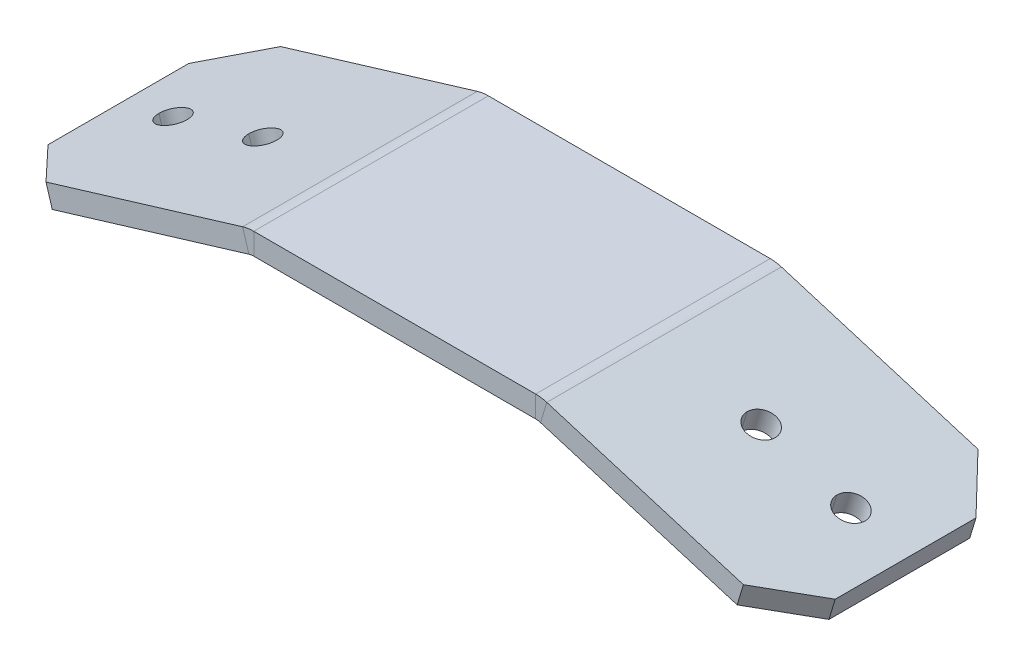
ISO-10303-21;
HEADER;
FILE_DESCRIPTION(('STEP AP214'),'2;1');
FILE_NAME('part.step','',(''),(''),'','','');
FILE_SCHEMA(('AUTOMOTIVE_DESIGN { 1 0 10303 214 1 1 1 1 }'));
ENDSEC;
DATA;
#1=APPLICATION_CONTEXT('core data for automotive mechanical design processes');
#2=APPLICATION_PROTOCOL_DEFINITION('international standard','automotive_design',2000,#1);
#3=PRODUCT_CONTEXT('',#1,'mechanical');
#4=PRODUCT('Part','Part','',(#3));
#5=PRODUCT_RELATED_PRODUCT_CATEGORY('part','',(#4));
#6=PRODUCT_DEFINITION_FORMATION('','',#4);
#7=PRODUCT_DEFINITION_CONTEXT('part definition',#1,'design');
#8=PRODUCT_DEFINITION('design','',#6,#7);
#9=PRODUCT_DEFINITION_SHAPE('','',#8);
#10=(LENGTH_UNIT() NAMED_UNIT(*) SI_UNIT(.MILLI.,.METRE.));
#11=(NAMED_UNIT(*) PLANE_ANGLE_UNIT() SI_UNIT($,.RADIAN.));
#12=(NAMED_UNIT(*) SI_UNIT($,.STERADIAN.) SOLID_ANGLE_UNIT());
#13=UNCERTAINTY_MEASURE_WITH_UNIT(LENGTH_MEASURE(1.E-05),#10,'distance_accuracy_value','');
#14=(GEOMETRIC_REPRESENTATION_CONTEXT(3) GLOBAL_UNCERTAINTY_ASSIGNED_CONTEXT((#13)) GLOBAL_UNIT_ASSIGNED_CONTEXT((#10,
#11,#12)) REPRESENTATION_CONTEXT('',''));
#15=CARTESIAN_POINT('',(0.,0.,0.));
#16=DIRECTION('',(0.,0.,1.));
#17=DIRECTION('',(1.,0.,0.));
#18=AXIS2_PLACEMENT_3D('',#15,#16,#17);
#19=CARTESIAN_POINT('',(33.7222877567762,5.92021227907714,0.));
#20=DIRECTION('',(0.289867105644568,0.957066905218878,0.));
#21=DIRECTION('',(-0.957066905218878,0.289867105644568,0.));
#22=AXIS2_PLACEMENT_3D('',#19,#20,#21);
#23=CYLINDRICAL_SURFACE('',#22,1.984375);
#24=CARTESIAN_POINT('',(32.8755859411883,3.1246198489328,0.));
#25=DIRECTION('',(-0.289867105644568,-0.957066905218878,0.));
#26=DIRECTION('',(0.957066905218878,-0.289867105644568,0.));
#27=AXIS2_PLACEMENT_3D('',#24,#25,#26);
#28=CIRCLE('',#27,1.984375);
#29=CARTESIAN_POINT('',(30.9764063011446,3.69982488669623,0.));
#30=VERTEX_POINT('',#29);
#31=CARTESIAN_POINT('',(34.774765581232,2.54941481116936,0.));
#32=VERTEX_POINT('',#31);
#33=EDGE_CURVE('E11',#30,#32,#28,.T.);
#34=ORIENTED_EDGE('',*,*,#33,.T.);
#35=DIRECTION('',(0.289867105644568,0.957066905218878,0.));
#36=VECTOR('',#35,1.);
#37=CARTESIAN_POINT('',(35.6214673968199,5.3450072413137,0.));
#38=LINE('',#37,#36);
#39=CARTESIAN_POINT('',(35.6214673968199,5.3450072413137,0.));
#40=VERTEX_POINT('',#39);
#41=EDGE_CURVE('E28',#32,#40,#38,.T.);
#42=ORIENTED_EDGE('',*,*,#41,.T.);
#43=CARTESIAN_POINT('',(33.7222877567762,5.92021227907714,0.));
#44=DIRECTION('',(0.289867105644568,0.957066905218878,0.));
#45=DIRECTION('',(-0.957066905218878,0.289867105644568,0.));
#46=AXIS2_PLACEMENT_3D('',#43,#44,#45);
#47=CIRCLE('',#46,1.984375);
#48=CARTESIAN_POINT('',(31.8231081167324,6.49541731684057,0.));
#49=VERTEX_POINT('',#48);
#50=EDGE_CURVE('E309',#40,#49,#47,.T.);
#51=ORIENTED_EDGE('',*,*,#50,.T.);
#52=DIRECTION('',(0.289867105644568,0.957066905218878,0.));
#53=VECTOR('',#52,1.);
#54=CARTESIAN_POINT('',(31.8231081167324,6.49541731684057,0.));
#55=LINE('',#54,#53);
#56=EDGE_CURVE('E263',#30,#49,#55,.T.);
#57=ORIENTED_EDGE('',*,*,#56,.F.);
#58=EDGE_LOOP('',(#34,#42,#51,#57));
#59=FACE_BOUND('',#58,.T.);
#60=ADVANCED_FACE('F17',(#59),#23,.F.);
#61=CARTESIAN_POINT('',(45.8770374530559,2.23890003739113,0.));
#62=DIRECTION('',(0.289867105644568,0.957066905218878,0.));
#63=DIRECTION('',(-0.957066905218878,0.289867105644568,0.));
#64=AXIS2_PLACEMENT_3D('',#61,#62,#63);
#65=CYLINDRICAL_SURFACE('',#64,1.984375);
#66=CARTESIAN_POINT('',(45.0303356374681,-0.556692392753209,0.));
#67=DIRECTION('',(-0.289867105644568,-0.957066905218878,0.));
#68=DIRECTION('',(0.957066905218878,-0.289867105644568,0.));
#69=AXIS2_PLACEMENT_3D('',#66,#67,#68);
#70=CIRCLE('',#69,1.984375);
#71=CARTESIAN_POINT('',(43.1311559974244,0.018512645010225,0.));
#72=VERTEX_POINT('',#71);
#73=CARTESIAN_POINT('',(46.9295152775118,-1.13189743051664,0.));
#74=VERTEX_POINT('',#73);
#75=EDGE_CURVE('E305',#72,#74,#70,.T.);
#76=ORIENTED_EDGE('',*,*,#75,.T.);
#77=DIRECTION('',(0.289867105644568,0.957066905218878,0.));
#78=VECTOR('',#77,1.);
#79=CARTESIAN_POINT('',(47.7762170930996,1.66369499962769,0.));
#80=LINE('',#79,#78);
#81=CARTESIAN_POINT('',(47.7762170930996,1.6636949996277,0.));
#82=VERTEX_POINT('',#81);
#83=EDGE_CURVE('E310',#74,#82,#80,.T.);
#84=ORIENTED_EDGE('',*,*,#83,.T.);
#85=CARTESIAN_POINT('',(45.8770374530559,2.23890003739114,0.));
#86=DIRECTION('',(0.289867105644568,0.957066905218878,0.));
#87=DIRECTION('',(-0.957066905218878,0.289867105644568,0.));
#88=AXIS2_PLACEMENT_3D('',#85,#86,#87);
#89=CIRCLE('',#88,1.984375);
#90=CARTESIAN_POINT('',(43.9778578130121,2.81410507515457,0.));
#91=VERTEX_POINT('',#90);
#92=EDGE_CURVE('E417',#82,#91,#89,.T.);
#93=ORIENTED_EDGE('',*,*,#92,.T.);
#94=DIRECTION('',(0.289867105644568,0.957066905218878,0.));
#95=VECTOR('',#94,1.);
#96=CARTESIAN_POINT('',(43.9778578130121,2.81410507515457,0.));
#97=LINE('',#96,#95);
#98=EDGE_CURVE('E300',#72,#91,#97,.T.);
#99=ORIENTED_EDGE('',*,*,#98,.F.);
#100=EDGE_LOOP('',(#76,#84,#93,#99));
#101=FACE_BOUND('',#100,.T.);
#102=ADVANCED_FACE('F630',(#101),#65,.F.);
#103=CARTESIAN_POINT('',(-33.7222877567762,5.92021227907714,0.));
#104=DIRECTION('',(-0.289867105644568,0.957066905218878,0.));
#105=DIRECTION('',(-0.957066905218878,-0.289867105644568,0.));
#106=AXIS2_PLACEMENT_3D('',#103,#104,#105);
#107=CYLINDRICAL_SURFACE('',#106,1.984375);
#108=CARTESIAN_POINT('',(-32.8755859411883,3.12461984893278,0.));
#109=DIRECTION('',(0.289867105644568,-0.957066905218878,0.));
#110=DIRECTION('',(0.957066905218878,0.289867105644568,0.));
#111=AXIS2_PLACEMENT_3D('',#108,#109,#110);
#112=CIRCLE('',#111,1.984375);
#113=CARTESIAN_POINT('',(-34.774765581232,2.54941481116935,0.));
#114=VERTEX_POINT('',#113);
#115=CARTESIAN_POINT('',(-30.9764063011446,3.69982488669622,0.));
#116=VERTEX_POINT('',#115);
#117=EDGE_CURVE('E353',#114,#116,#112,.T.);
#118=ORIENTED_EDGE('',*,*,#117,.T.);
#119=DIRECTION('',(-0.289867105644568,0.957066905218878,0.));
#120=VECTOR('',#119,1.);
#121=CARTESIAN_POINT('',(-31.8231081167324,6.49541731684057,0.));
#122=LINE('',#121,#120);
#123=CARTESIAN_POINT('',(-31.8231081167324,6.49541731684057,0.));
#124=VERTEX_POINT('',#123);
#125=EDGE_CURVE('E293',#116,#124,#122,.T.);
#126=ORIENTED_EDGE('',*,*,#125,.T.);
#127=CARTESIAN_POINT('',(-33.7222877567762,5.92021227907714,0.));
#128=DIRECTION('',(-0.289867105644568,0.957066905218878,0.));
#129=DIRECTION('',(-0.957066905218878,-0.289867105644568,0.));
#130=AXIS2_PLACEMENT_3D('',#127,#128,#129);
#131=CIRCLE('',#130,1.984375);
#132=CARTESIAN_POINT('',(-35.6214673968199,5.3450072413137,0.));
#133=VERTEX_POINT('',#132);
#134=EDGE_CURVE('E289',#124,#133,#131,.T.);
#135=ORIENTED_EDGE('',*,*,#134,.T.);
#136=DIRECTION('',(-0.289867105644568,0.957066905218878,0.));
#137=VECTOR('',#136,1.);
#138=CARTESIAN_POINT('',(-35.6214673968199,5.3450072413137,0.));
#139=LINE('',#138,#137);
#140=EDGE_CURVE('E475',#114,#133,#139,.T.);
#141=ORIENTED_EDGE('',*,*,#140,.F.);
#142=EDGE_LOOP('',(#118,#126,#135,#141));
#143=FACE_BOUND('',#142,.T.);
#144=ADVANCED_FACE('F637',(#143),#107,.F.);
#145=CARTESIAN_POINT('',(-45.8770374530559,2.23890003739113,0.));
#146=DIRECTION('',(-0.289867105644568,0.957066905218878,0.));
#147=DIRECTION('',(-0.957066905218878,-0.289867105644568,0.));
#148=AXIS2_PLACEMENT_3D('',#145,#146,#147);
#149=CYLINDRICAL_SURFACE('',#148,1.984375);
#150=CARTESIAN_POINT('',(-45.0303356374681,-0.556692392753219,0.));
#151=DIRECTION('',(0.289867105644568,-0.957066905218878,0.));
#152=DIRECTION('',(0.957066905218878,0.289867105644568,0.));
#153=AXIS2_PLACEMENT_3D('',#150,#151,#152);
#154=CIRCLE('',#153,1.984375);
#155=CARTESIAN_POINT('',(-46.9295152775118,-1.13189743051665,0.));
#156=VERTEX_POINT('',#155);
#157=CARTESIAN_POINT('',(-43.1311559974244,0.0185126450102154,0.));
#158=VERTEX_POINT('',#157);
#159=EDGE_CURVE('E294',#156,#158,#154,.T.);
#160=ORIENTED_EDGE('',*,*,#159,.T.);
#161=DIRECTION('',(-0.289867105644568,0.957066905218878,0.));
#162=VECTOR('',#161,1.);
#163=CARTESIAN_POINT('',(-43.9778578130121,2.81410507515457,0.));
#164=LINE('',#163,#162);
#165=CARTESIAN_POINT('',(-43.9778578130121,2.81410507515457,0.));
#166=VERTEX_POINT('',#165);
#167=EDGE_CURVE('E162',#158,#166,#164,.T.);
#168=ORIENTED_EDGE('',*,*,#167,.T.);
#169=CARTESIAN_POINT('',(-45.8770374530559,2.23890003739114,0.));
#170=DIRECTION('',(-0.289867105644568,0.957066905218878,0.));
#171=DIRECTION('',(-0.957066905218878,-0.289867105644568,0.));
#172=AXIS2_PLACEMENT_3D('',#169,#170,#171);
#173=CIRCLE('',#172,1.984375);
#174=CARTESIAN_POINT('',(-47.7762170930996,1.6636949996277,0.));
#175=VERTEX_POINT('',#174);
#176=EDGE_CURVE('E174',#166,#175,#173,.T.);
#177=ORIENTED_EDGE('',*,*,#176,.T.);
#178=DIRECTION('',(-0.289867105644568,0.957066905218878,0.));
#179=VECTOR('',#178,1.);
#180=CARTESIAN_POINT('',(-47.7762170930996,1.66369499962769,0.));
#181=LINE('',#180,#179);
#182=EDGE_CURVE('E295',#156,#175,#181,.T.);
#183=ORIENTED_EDGE('',*,*,#182,.F.);
#184=EDGE_LOOP('',(#160,#168,#177,#183));
#185=FACE_BOUND('',#184,.T.);
#186=ADVANCED_FACE('F657',(#185),#149,.F.);
#187=CARTESIAN_POINT('',(-20.5818634814597,9.90005604011125,-15.875));
#188=DIRECTION('',(0.,0.,-1.));
#189=DIRECTION('',(0.,-1.,0.));
#190=AXIS2_PLACEMENT_3D('',#187,#188,#189);
#191=PLANE('',#190);
#192=DIRECTION('',(0.289867105644566,-0.957066905218879,0.));
#193=VECTOR('',#192,1.);
#194=CARTESIAN_POINT('',(-20.5818634814597,9.90005604011125,-15.875));
#195=LINE('',#194,#193);
#196=CARTESIAN_POINT('',(-20.5818634814597,9.90005604011125,-15.875));
#197=VERTEX_POINT('',#196);
#198=CARTESIAN_POINT('',(-19.7351616658719,7.10446360996689,-15.875));
#199=VERTEX_POINT('',#198);
#200=EDGE_CURVE('E259',#197,#199,#195,.T.);
#201=ORIENTED_EDGE('',*,*,#200,.F.);
#202=CARTESIAN_POINT('',(-19.0725254623684,4.91660866463653,-15.875));
#203=DIRECTION('',(0.,0.,-1.));
#204=DIRECTION('',(1.,0.,0.));
#205=AXIS2_PLACEMENT_3D('',#202,#203,#204);
#206=CIRCLE('',#205,5.207);
#207=CARTESIAN_POINT('',(-19.0725254623684,10.1236086646365,-15.875));
#208=VERTEX_POINT('',#207);
#209=EDGE_CURVE('E420',#197,#208,#206,.T.);
#210=ORIENTED_EDGE('',*,*,#209,.T.);
#211=DIRECTION('',(0.,1.,0.));
#212=VECTOR('',#211,1.);
#213=CARTESIAN_POINT('',(-19.0725254623684,7.20260866463652,-15.875));
#214=LINE('',#213,#212);
#215=CARTESIAN_POINT('',(-19.0725254623684,7.20260866463652,-15.875));
#216=VERTEX_POINT('',#215);
#217=EDGE_CURVE('E21',#216,#208,#214,.T.);
#218=ORIENTED_EDGE('',*,*,#217,.F.);
#219=CARTESIAN_POINT('',(-19.0725254623684,4.91660866463653,-15.875));
#220=DIRECTION('',(0.,0.,-1.));
#221=DIRECTION('',(1.,0.,0.));
#222=AXIS2_PLACEMENT_3D('',#219,#220,#221);
#223=CIRCLE('',#222,2.286);
#224=EDGE_CURVE('E311',#199,#216,#223,.T.);
#225=ORIENTED_EDGE('',*,*,#224,.F.);
#226=EDGE_LOOP('',(#201,#210,#218,#225));
#227=FACE_BOUND('',#226,.T.);
#228=ADVANCED_FACE('F531',(#227),#191,.T.);
#229=CARTESIAN_POINT('',(-19.0725254623684,7.20260866463652,-15.875));
#230=DIRECTION('',(0.,0.,-1.));
#231=DIRECTION('',(0.,-1.,0.));
#232=AXIS2_PLACEMENT_3D('',#229,#230,#231);
#233=PLANE('',#232);
#234=DIRECTION('',(0.957066905218878,0.289867105644568,0.));
#235=VECTOR('',#234,1.);
#236=CARTESIAN_POINT('',(-52.4226098491815,-2.79559243014434,-15.875));
#237=LINE('',#236,#235);
#238=CARTESIAN_POINT('',(-46.3452350010417,-0.954936309301339,-15.875));
#239=VERTEX_POINT('',#238);
#240=EDGE_CURVE('E242',#239,#199,#237,.T.);
#241=ORIENTED_EDGE('',*,*,#240,.F.);
#242=DIRECTION('',(-0.289867105644568,0.957066905218878,0.));
#243=VECTOR('',#242,1.);
#244=CARTESIAN_POINT('',(-47.1919368166294,1.840656120843,-15.875));
#245=LINE('',#244,#243);
#246=CARTESIAN_POINT('',(-47.1919368166294,1.840656120843,-15.875));
#247=VERTEX_POINT('',#246);
#248=EDGE_CURVE('E239',#239,#247,#245,.T.);
#249=ORIENTED_EDGE('',*,*,#248,.T.);
#250=DIRECTION('',(0.957066905218878,0.289867105644568,0.));
#251=VECTOR('',#250,1.);
#252=CARTESIAN_POINT('',(-53.2693116647693,0.,-15.875));
#253=LINE('',#252,#251);
#254=EDGE_CURVE('E255',#247,#197,#253,.T.);
#255=ORIENTED_EDGE('',*,*,#254,.T.);
#256=ORIENTED_EDGE('',*,*,#200,.T.);
#257=EDGE_LOOP('',(#241,#249,#255,#256));
#258=FACE_BOUND('',#257,.T.);
#259=ADVANCED_FACE('F646',(#258),#233,.T.);
#260=CARTESIAN_POINT('',(-19.0725254623684,10.1236086646365,15.875));
#261=DIRECTION('',(0.,0.,1.));
#262=DIRECTION('',(1.,0.,0.));
#263=AXIS2_PLACEMENT_3D('',#260,#261,#262);
#264=PLANE('',#263);
#265=DIRECTION('',(0.,-1.,0.));
#266=VECTOR('',#265,1.);
#267=CARTESIAN_POINT('',(-19.0725254623684,10.1236086646365,15.875));
#268=LINE('',#267,#266);
#269=CARTESIAN_POINT('',(-19.0725254623684,10.1236086646365,15.875));
#270=VERTEX_POINT('',#269);
#271=CARTESIAN_POINT('',(-19.0725254623684,7.20260866463652,15.875));
#272=VERTEX_POINT('',#271);
#273=EDGE_CURVE('E323',#270,#272,#268,.T.);
#274=ORIENTED_EDGE('',*,*,#273,.F.);
#275=CARTESIAN_POINT('',(-19.0725254623684,4.91660866463653,15.875));
#276=DIRECTION('',(0.,0.,-1.));
#277=DIRECTION('',(1.,0.,0.));
#278=AXIS2_PLACEMENT_3D('',#275,#276,#277);
#279=CIRCLE('',#278,5.207);
#280=CARTESIAN_POINT('',(-20.5818634814597,9.90005604011125,15.875));
#281=VERTEX_POINT('',#280);
#282=EDGE_CURVE('E343',#281,#270,#279,.T.);
#283=ORIENTED_EDGE('',*,*,#282,.F.);
#284=DIRECTION('',(-0.289867105644566,0.957066905218879,0.));
#285=VECTOR('',#284,1.);
#286=CARTESIAN_POINT('',(-19.7351616658719,7.10446360996689,15.875));
#287=LINE('',#286,#285);
#288=CARTESIAN_POINT('',(-19.7351616658719,7.10446360996689,15.875));
#289=VERTEX_POINT('',#288);
#290=EDGE_CURVE('E284',#289,#281,#287,.T.);
#291=ORIENTED_EDGE('',*,*,#290,.F.);
#292=CARTESIAN_POINT('',(-19.0725254623684,4.91660866463653,15.875));
#293=DIRECTION('',(0.,0.,-1.));
#294=DIRECTION('',(1.,0.,0.));
#295=AXIS2_PLACEMENT_3D('',#292,#293,#294);
#296=CIRCLE('',#295,2.286);
#297=EDGE_CURVE('E330',#289,#272,#296,.T.);
#298=ORIENTED_EDGE('',*,*,#297,.T.);
#299=EDGE_LOOP('',(#274,#283,#291,#298));
#300=FACE_BOUND('',#299,.T.);
#301=ADVANCED_FACE('F648',(#300),#264,.T.);
#302=CARTESIAN_POINT('',(-19.7351616658719,7.10446360996689,15.875));
#303=DIRECTION('',(0.,0.,1.));
#304=DIRECTION('',(1.,0.,0.));
#305=AXIS2_PLACEMENT_3D('',#302,#303,#304);
#306=PLANE('',#305);
#307=DIRECTION('',(1.,0.,0.));
#308=VECTOR('',#307,1.);
#309=CARTESIAN_POINT('',(-19.84375,10.1236086646365,15.875));
#310=LINE('',#309,#308);
#311=CARTESIAN_POINT('',(19.0725254623683,10.1236086646365,15.875));
#312=VERTEX_POINT('',#311);
#313=EDGE_CURVE('E388',#270,#312,#310,.T.);
#314=ORIENTED_EDGE('',*,*,#313,.F.);
#315=ORIENTED_EDGE('',*,*,#273,.T.);
#316=DIRECTION('',(1.,0.,0.));
#317=VECTOR('',#316,1.);
#318=CARTESIAN_POINT('',(-19.84375,7.20260866463652,15.875));
#319=LINE('',#318,#317);
#320=CARTESIAN_POINT('',(19.0725254623683,7.20260866463655,15.875));
#321=VERTEX_POINT('',#320);
#322=EDGE_CURVE('E318',#272,#321,#319,.T.);
#323=ORIENTED_EDGE('',*,*,#322,.T.);
#324=DIRECTION('',(0.,1.,0.));
#325=VECTOR('',#324,1.);
#326=CARTESIAN_POINT('',(19.0725254623683,7.20260866463655,15.875));
#327=LINE('',#326,#325);
#328=EDGE_CURVE('E314',#321,#312,#327,.T.);
#329=ORIENTED_EDGE('',*,*,#328,.T.);
#330=EDGE_LOOP('',(#314,#315,#323,#329));
#331=FACE_BOUND('',#330,.T.);
#332=ADVANCED_FACE('F615',(#331),#306,.T.);
#333=CARTESIAN_POINT('',(19.0725254623683,10.1236086646365,-15.875));
#334=DIRECTION('',(0.,0.,-1.));
#335=DIRECTION('',(0.,-1.,0.));
#336=AXIS2_PLACEMENT_3D('',#333,#334,#335);
#337=PLANE('',#336);
#338=DIRECTION('',(0.,-1.,0.));
#339=VECTOR('',#338,1.);
#340=CARTESIAN_POINT('',(19.0725254623683,10.1236086646365,-15.875));
#341=LINE('',#340,#339);
#342=CARTESIAN_POINT('',(19.0725254623683,10.1236086646365,-15.875));
#343=VERTEX_POINT('',#342);
#344=CARTESIAN_POINT('',(19.0725254623683,7.20260866463655,-15.875));
#345=VERTEX_POINT('',#344);
#346=EDGE_CURVE('E337',#343,#345,#341,.T.);
#347=ORIENTED_EDGE('',*,*,#346,.F.);
#348=CARTESIAN_POINT('',(19.0725254623684,4.91660866463655,-15.875));
#349=DIRECTION('',(0.,0.,-1.));
#350=DIRECTION('',(1.,0.,0.));
#351=AXIS2_PLACEMENT_3D('',#348,#349,#350);
#352=CIRCLE('',#351,5.207);
#353=CARTESIAN_POINT('',(20.5818634814596,9.90005604011127,-15.875));
#354=VERTEX_POINT('',#353);
#355=EDGE_CURVE('E319',#343,#354,#352,.T.);
#356=ORIENTED_EDGE('',*,*,#355,.T.);
#357=DIRECTION('',(0.289867105644567,0.957066905218878,0.));
#358=VECTOR('',#357,1.);
#359=CARTESIAN_POINT('',(19.7351616658719,7.10446360996693,-15.875));
#360=LINE('',#359,#358);
#361=CARTESIAN_POINT('',(19.7351616658719,7.10446360996693,-15.875));
#362=VERTEX_POINT('',#361);
#363=EDGE_CURVE('E435',#362,#354,#360,.T.);
#364=ORIENTED_EDGE('',*,*,#363,.F.);
#365=CARTESIAN_POINT('',(19.0725254623684,4.91660866463655,-15.875));
#366=DIRECTION('',(0.,0.,-1.));
#367=DIRECTION('',(1.,0.,0.));
#368=AXIS2_PLACEMENT_3D('',#365,#366,#367);
#369=CIRCLE('',#368,2.286);
#370=EDGE_CURVE('E288',#345,#362,#369,.T.);
#371=ORIENTED_EDGE('',*,*,#370,.F.);
#372=EDGE_LOOP('',(#347,#356,#364,#371));
#373=FACE_BOUND('',#372,.T.);
#374=ADVANCED_FACE('F606',(#373),#337,.T.);
#375=CARTESIAN_POINT('',(19.7351616658719,7.10446360996693,-15.875));
#376=DIRECTION('',(0.,0.,-1.));
#377=DIRECTION('',(0.,-1.,0.));
#378=AXIS2_PLACEMENT_3D('',#375,#376,#377);
#379=PLANE('',#378);
#380=DIRECTION('',(1.,0.,0.));
#381=VECTOR('',#380,1.);
#382=CARTESIAN_POINT('',(-19.84375,10.1236086646365,-15.875));
#383=LINE('',#382,#381);
#384=EDGE_CURVE('E333',#208,#343,#383,.T.);
#385=ORIENTED_EDGE('',*,*,#384,.T.);
#386=ORIENTED_EDGE('',*,*,#346,.T.);
#387=DIRECTION('',(1.,0.,0.));
#388=VECTOR('',#387,1.);
#389=CARTESIAN_POINT('',(-19.84375,7.20260866463652,-15.875));
#390=LINE('',#389,#388);
#391=EDGE_CURVE('E274',#216,#345,#390,.T.);
#392=ORIENTED_EDGE('',*,*,#391,.F.);
#393=ORIENTED_EDGE('',*,*,#217,.T.);
#394=EDGE_LOOP('',(#385,#386,#392,#393));
#395=FACE_BOUND('',#394,.T.);
#396=ADVANCED_FACE('F607',(#395),#379,.T.);
#397=CARTESIAN_POINT('',(20.5818634814596,9.90005604011127,15.875));
#398=DIRECTION('',(0.,0.,1.));
#399=DIRECTION('',(1.,0.,0.));
#400=AXIS2_PLACEMENT_3D('',#397,#398,#399);
#401=PLANE('',#400);
#402=DIRECTION('',(-0.289867105644567,-0.957066905218878,0.));
#403=VECTOR('',#402,1.);
#404=CARTESIAN_POINT('',(20.5818634814596,9.90005604011127,15.875));
#405=LINE('',#404,#403);
#406=CARTESIAN_POINT('',(20.5818634814596,9.90005604011127,15.875));
#407=VERTEX_POINT('',#406);
#408=CARTESIAN_POINT('',(19.7351616658719,7.10446360996693,15.875));
#409=VERTEX_POINT('',#408);
#410=EDGE_CURVE('E272',#407,#409,#405,.T.);
#411=ORIENTED_EDGE('',*,*,#410,.F.);
#412=CARTESIAN_POINT('',(19.0725254623684,4.91660866463655,15.875));
#413=DIRECTION('',(0.,0.,-1.));
#414=DIRECTION('',(1.,0.,0.));
#415=AXIS2_PLACEMENT_3D('',#412,#413,#414);
#416=CIRCLE('',#415,5.207);
#417=EDGE_CURVE('E379',#312,#407,#416,.T.);
#418=ORIENTED_EDGE('',*,*,#417,.F.);
#419=ORIENTED_EDGE('',*,*,#328,.F.);
#420=CARTESIAN_POINT('',(19.0725254623684,4.91660866463655,15.875));
#421=DIRECTION('',(0.,0.,-1.));
#422=DIRECTION('',(1.,0.,0.));
#423=AXIS2_PLACEMENT_3D('',#420,#421,#422);
#424=CIRCLE('',#423,2.286);
#425=EDGE_CURVE('E357',#321,#409,#424,.T.);
#426=ORIENTED_EDGE('',*,*,#425,.T.);
#427=EDGE_LOOP('',(#411,#418,#419,#426));
#428=FACE_BOUND('',#427,.T.);
#429=ADVANCED_FACE('F616',(#428),#401,.T.);
#430=CARTESIAN_POINT('',(19.0725254623683,7.20260866463655,15.875));
#431=DIRECTION('',(0.,0.,1.));
#432=DIRECTION('',(1.,0.,0.));
#433=AXIS2_PLACEMENT_3D('',#430,#431,#432);
#434=PLANE('',#433);
#435=DIRECTION('',(0.957066905218878,-0.289867105644568,0.));
#436=VECTOR('',#435,1.);
#437=CARTESIAN_POINT('',(18.9970481844122,7.32801623449218,15.875));
#438=LINE('',#437,#436);
#439=CARTESIAN_POINT('',(46.3452350010417,-0.954936309301322,15.875));
#440=VERTEX_POINT('',#439);
#441=EDGE_CURVE('E354',#409,#440,#438,.T.);
#442=ORIENTED_EDGE('',*,*,#441,.T.);
#443=DIRECTION('',(0.289867105644571,0.957066905218877,0.));
#444=VECTOR('',#443,1.);
#445=CARTESIAN_POINT('',(47.1919368166295,1.84065612084303,15.875));
#446=LINE('',#445,#444);
#447=CARTESIAN_POINT('',(47.1919368166295,1.84065612084301,15.875));
#448=VERTEX_POINT('',#447);
#449=EDGE_CURVE('E358',#440,#448,#446,.T.);
#450=ORIENTED_EDGE('',*,*,#449,.T.);
#451=DIRECTION('',(0.957066905218878,-0.289867105644568,0.));
#452=VECTOR('',#451,1.);
#453=CARTESIAN_POINT('',(19.84375,10.1236086646365,15.875));
#454=LINE('',#453,#452);
#455=EDGE_CURVE('E371',#407,#448,#454,.T.);
#456=ORIENTED_EDGE('',*,*,#455,.F.);
#457=ORIENTED_EDGE('',*,*,#410,.T.);
#458=EDGE_LOOP('',(#442,#450,#456,#457));
#459=FACE_BOUND('',#458,.T.);
#460=ADVANCED_FACE('F591',(#459),#434,.T.);
#461=CARTESIAN_POINT('',(18.9970481844122,7.32801623449218,-15.875));
#462=DIRECTION('',(-0.289867105644568,-0.957066905218878,0.));
#463=DIRECTION('',(-0.957066905218878,0.289867105644568,0.));
#464=AXIS2_PLACEMENT_3D('',#461,#462,#463);
#465=PLANE('',#464);
#466=DIRECTION('',(0.957066905218878,-0.289867105644568,0.));
#467=VECTOR('',#466,1.);
#468=CARTESIAN_POINT('',(18.9970481844122,7.32801623449218,-15.875));
#469=LINE('',#468,#467);
#470=CARTESIAN_POINT('',(46.3452350010416,-0.954936309301321,-15.875));
#471=VERTEX_POINT('',#470);
#472=EDGE_CURVE('E268',#362,#471,#469,.T.);
#473=ORIENTED_EDGE('',*,*,#472,.T.);
#474=DIRECTION('',(0.676748498729492,-0.204966996044191,0.707106781186547));
#475=VECTOR('',#474,1.);
#476=CARTESIAN_POINT('',(32.671141592727,3.18653996259543,-30.1625));
#477=LINE('',#476,#475);
#478=CARTESIAN_POINT('',(52.4226098491815,-2.79559243014433,-9.525));
#479=VERTEX_POINT('',#478);
#480=EDGE_CURVE('E273',#471,#479,#477,.T.);
#481=ORIENTED_EDGE('',*,*,#480,.T.);
#482=DIRECTION('',(0.,0.,1.));
#483=VECTOR('',#482,1.);
#484=CARTESIAN_POINT('',(52.4226098491815,-2.79559243014433,-15.875));
#485=LINE('',#484,#483);
#486=CARTESIAN_POINT('',(52.4226098491815,-2.79559243014433,9.525));
#487=VERTEX_POINT('',#486);
#488=EDGE_CURVE('E455',#479,#487,#485,.T.);
#489=ORIENTED_EDGE('',*,*,#488,.T.);
#490=DIRECTION('',(-0.676748498729491,0.204966996044191,0.707106781186548));
#491=VECTOR('',#490,1.);
#492=CARTESIAN_POINT('',(47.8645787130766,-1.41510033951208,14.2875));
#493=LINE('',#492,#491);
#494=EDGE_CURVE('E472',#487,#440,#493,.T.);
#495=ORIENTED_EDGE('',*,*,#494,.T.);
#496=ORIENTED_EDGE('',*,*,#441,.F.);
#497=DIRECTION('',(0.,0.,1.));
#498=VECTOR('',#497,1.);
#499=CARTESIAN_POINT('',(19.7351616658719,7.10446360996693,-15.875));
#500=LINE('',#499,#498);
#501=EDGE_CURVE('E277',#362,#409,#500,.T.);
#502=ORIENTED_EDGE('',*,*,#501,.F.);
#503=EDGE_LOOP('',(#473,#481,#489,#495,#496,#502));
#504=FACE_BOUND('',#503,.T.);
#505=ORIENTED_EDGE('',*,*,#33,.F.);
#506=CARTESIAN_POINT('',(32.8755859411883,3.1246198489328,0.));
#507=DIRECTION('',(-0.289867105644568,-0.957066905218878,0.));
#508=DIRECTION('',(0.957066905218878,-0.289867105644568,0.));
#509=AXIS2_PLACEMENT_3D('',#506,#507,#508);
#510=CIRCLE('',#509,1.984375);
#511=EDGE_CURVE('E266',#32,#30,#510,.T.);
#512=ORIENTED_EDGE('',*,*,#511,.F.);
#513=EDGE_LOOP('',(#505,#512));
#514=FACE_BOUND('',#513,.T.);
#515=ORIENTED_EDGE('',*,*,#75,.F.);
#516=CARTESIAN_POINT('',(45.0303356374681,-0.556692392753209,0.));
#517=DIRECTION('',(-0.289867105644568,-0.957066905218878,0.));
#518=DIRECTION('',(0.957066905218878,-0.289867105644568,0.));
#519=AXIS2_PLACEMENT_3D('',#516,#517,#518);
#520=CIRCLE('',#519,1.984375);
#521=EDGE_CURVE('E303',#74,#72,#520,.T.);
#522=ORIENTED_EDGE('',*,*,#521,.F.);
#523=EDGE_LOOP('',(#515,#522));
#524=FACE_BOUND('',#523,.T.);
#525=ADVANCED_FACE('F597',(#504,#514,#524),#465,.T.);
#526=CARTESIAN_POINT('',(19.0725254623684,4.91660866463655,-15.875));
#527=DIRECTION('',(0.,0.,1.));
#528=DIRECTION('',(1.,0.,0.));
#529=AXIS2_PLACEMENT_3D('',#526,#527,#528);
#530=CYLINDRICAL_SURFACE('',#529,2.286);
#531=ORIENTED_EDGE('',*,*,#425,.F.);
#532=DIRECTION('',(0.,0.,1.));
#533=VECTOR('',#532,1.);
#534=CARTESIAN_POINT('',(19.0725254623683,7.20260866463655,-15.875));
#535=LINE('',#534,#533);
#536=EDGE_CURVE('E278',#345,#321,#535,.T.);
#537=ORIENTED_EDGE('',*,*,#536,.F.);
#538=ORIENTED_EDGE('',*,*,#370,.T.);
#539=ORIENTED_EDGE('',*,*,#501,.T.);
#540=EDGE_LOOP('',(#531,#537,#538,#539));
#541=FACE_BOUND('',#540,.T.);
#542=ADVANCED_FACE('F604',(#541),#530,.F.);
#543=CARTESIAN_POINT('',(-19.84375,7.20260866463652,-15.875));
#544=DIRECTION('',(0.,-1.,0.));
#545=DIRECTION('',(0.,0.,-1.));
#546=AXIS2_PLACEMENT_3D('',#543,#544,#545);
#547=PLANE('',#546);
#548=ORIENTED_EDGE('',*,*,#322,.F.);
#549=DIRECTION('',(0.,0.,1.));
#550=VECTOR('',#549,1.);
#551=CARTESIAN_POINT('',(-19.0725254623684,7.20260866463652,-15.875));
#552=LINE('',#551,#550);
#553=EDGE_CURVE('E241',#216,#272,#552,.T.);
#554=ORIENTED_EDGE('',*,*,#553,.F.);
#555=ORIENTED_EDGE('',*,*,#391,.T.);
#556=ORIENTED_EDGE('',*,*,#536,.T.);
#557=EDGE_LOOP('',(#548,#554,#555,#556));
#558=FACE_BOUND('',#557,.T.);
#559=ADVANCED_FACE('F1328',(#558),#547,.T.);
#560=CARTESIAN_POINT('',(-19.0725254623684,4.91660866463653,-15.875));
#561=DIRECTION('',(0.,0.,1.));
#562=DIRECTION('',(1.,0.,0.));
#563=AXIS2_PLACEMENT_3D('',#560,#561,#562);
#564=CYLINDRICAL_SURFACE('',#563,2.286);
#565=ORIENTED_EDGE('',*,*,#297,.F.);
#566=DIRECTION('',(0.,0.,1.));
#567=VECTOR('',#566,1.);
#568=CARTESIAN_POINT('',(-19.7351616658719,7.10446360996689,-15.875));
#569=LINE('',#568,#567);
#570=EDGE_CURVE('E251',#199,#289,#569,.T.);
#571=ORIENTED_EDGE('',*,*,#570,.F.);
#572=ORIENTED_EDGE('',*,*,#224,.T.);
#573=ORIENTED_EDGE('',*,*,#553,.T.);
#574=EDGE_LOOP('',(#565,#571,#572,#573));
#575=FACE_BOUND('',#574,.T.);
#576=ADVANCED_FACE('F663',(#575),#564,.F.);
#577=CARTESIAN_POINT('',(-52.4226098491815,-2.79559243014434,-15.875));
#578=DIRECTION('',(0.289867105644568,-0.957066905218878,0.));
#579=DIRECTION('',(0.,0.,-1.));
#580=AXIS2_PLACEMENT_3D('',#577,#578,#579);
#581=PLANE('',#580);
#582=DIRECTION('',(0.,0.,1.));
#583=VECTOR('',#582,1.);
#584=CARTESIAN_POINT('',(-52.4226098491815,-2.79559243014434,-15.875));
#585=LINE('',#584,#583);
#586=CARTESIAN_POINT('',(-52.4226098491815,-2.79559243014434,-9.525));
#587=VERTEX_POINT('',#586);
#588=CARTESIAN_POINT('',(-52.4226098491815,-2.79559243014434,9.525));
#589=VERTEX_POINT('',#588);
#590=EDGE_CURVE('E217',#587,#589,#585,.T.);
#591=ORIENTED_EDGE('',*,*,#590,.F.);
#592=DIRECTION('',(0.676748498729491,0.204966996044191,-0.707106781186548));
#593=VECTOR('',#592,1.);
#594=CARTESIAN_POINT('',(-49.3839224251116,-1.87526436972284,-12.7));
#595=LINE('',#594,#593);
#596=EDGE_CURVE('E221',#587,#239,#595,.T.);
#597=ORIENTED_EDGE('',*,*,#596,.T.);
#598=ORIENTED_EDGE('',*,*,#240,.T.);
#599=ORIENTED_EDGE('',*,*,#570,.T.);
#600=DIRECTION('',(0.957066905218878,0.289867105644568,0.));
#601=VECTOR('',#600,1.);
#602=CARTESIAN_POINT('',(-52.4226098491815,-2.79559243014434,15.875));
#603=LINE('',#602,#601);
#604=CARTESIAN_POINT('',(-46.3452350010417,-0.95493630930134,15.875));
#605=VERTEX_POINT('',#604);
#606=EDGE_CURVE('E279',#605,#289,#603,.T.);
#607=ORIENTED_EDGE('',*,*,#606,.F.);
#608=DIRECTION('',(-0.676748498729491,-0.204966996044191,-0.707106781186548));
#609=VECTOR('',#608,1.);
#610=CARTESIAN_POINT('',(-64.5773595454613,-6.47690467183035,-3.175));
#611=LINE('',#610,#609);
#612=EDGE_CURVE('E223',#605,#589,#611,.T.);
#613=ORIENTED_EDGE('',*,*,#612,.T.);
#614=EDGE_LOOP('',(#591,#597,#598,#599,#607,#613));
#615=FACE_BOUND('',#614,.T.);
#616=ORIENTED_EDGE('',*,*,#117,.F.);
#617=CARTESIAN_POINT('',(-32.8755859411883,3.12461984893278,0.));
#618=DIRECTION('',(0.289867105644568,-0.957066905218878,0.));
#619=DIRECTION('',(0.957066905218878,0.289867105644568,0.));
#620=AXIS2_PLACEMENT_3D('',#617,#618,#619);
#621=CIRCLE('',#620,1.984375);
#622=EDGE_CURVE('E378',#116,#114,#621,.T.);
#623=ORIENTED_EDGE('',*,*,#622,.F.);
#624=EDGE_LOOP('',(#616,#623));
#625=FACE_BOUND('',#624,.T.);
#626=ORIENTED_EDGE('',*,*,#159,.F.);
#627=CARTESIAN_POINT('',(-45.0303356374681,-0.556692392753219,0.));
#628=DIRECTION('',(0.289867105644568,-0.957066905218878,0.));
#629=DIRECTION('',(0.957066905218878,0.289867105644568,0.));
#630=AXIS2_PLACEMENT_3D('',#627,#628,#629);
#631=CIRCLE('',#630,1.984375);
#632=EDGE_CURVE('E298',#158,#156,#631,.T.);
#633=ORIENTED_EDGE('',*,*,#632,.F.);
#634=EDGE_LOOP('',(#626,#633));
#635=FACE_BOUND('',#634,.T.);
#636=ADVANCED_FACE('F219',(#615,#625,#635),#581,.T.);
#637=CARTESIAN_POINT('',(-52.4226098491815,-2.79559243014434,-15.875));
#638=DIRECTION('',(0.957066905218878,0.289867105644568,0.));
#639=DIRECTION('',(0.,0.,-1.));
#640=AXIS2_PLACEMENT_3D('',#637,#638,#639);
#641=PLANE('',#640);
#642=DIRECTION('',(0.,0.,1.));
#643=VECTOR('',#642,1.);
#644=CARTESIAN_POINT('',(-53.2693116647693,0.,-15.875));
#645=LINE('',#644,#643);
#646=CARTESIAN_POINT('',(-53.2693116647693,0.,-9.525));
#647=VERTEX_POINT('',#646);
#648=CARTESIAN_POINT('',(-53.2693116647693,0.,9.525));
#649=VERTEX_POINT('',#648);
#650=EDGE_CURVE('E245',#647,#649,#645,.T.);
#651=ORIENTED_EDGE('',*,*,#650,.F.);
#652=DIRECTION('',(0.289867105644568,-0.957066905218878,0.));
#653=VECTOR('',#652,1.);
#654=CARTESIAN_POINT('',(-52.4226098491815,-2.79559243014434,-9.525));
#655=LINE('',#654,#653);
#656=EDGE_CURVE('E229',#647,#587,#655,.T.);
#657=ORIENTED_EDGE('',*,*,#656,.T.);
#658=ORIENTED_EDGE('',*,*,#590,.T.);
#659=DIRECTION('',(-0.289867105644568,0.957066905218878,0.));
#660=VECTOR('',#659,1.);
#661=CARTESIAN_POINT('',(-53.2693116647693,0.,9.525));
#662=LINE('',#661,#660);
#663=EDGE_CURVE('E230',#589,#649,#662,.T.);
#664=ORIENTED_EDGE('',*,*,#663,.T.);
#665=EDGE_LOOP('',(#651,#657,#658,#664));
#666=FACE_BOUND('',#665,.T.);
#667=ADVANCED_FACE('F244',(#666),#641,.F.);
#668=CARTESIAN_POINT('',(-53.2693116647693,0.,-15.875));
#669=DIRECTION('',(0.289867105644568,-0.957066905218878,0.));
#670=DIRECTION('',(0.,0.,-1.));
#671=AXIS2_PLACEMENT_3D('',#668,#669,#670);
#672=PLANE('',#671);
#673=ORIENTED_EDGE('',*,*,#254,.F.);
#674=DIRECTION('',(-0.676748498729491,-0.204966996044191,0.707106781186548));
#675=VECTOR('',#674,1.);
#676=CARTESIAN_POINT('',(-47.1919368166294,1.840656120843,-15.875));
#677=LINE('',#676,#675);
#678=EDGE_CURVE('E260',#247,#647,#677,.T.);
#679=ORIENTED_EDGE('',*,*,#678,.T.);
#680=ORIENTED_EDGE('',*,*,#650,.T.);
#681=DIRECTION('',(0.676748498729491,0.204966996044191,0.707106781186548));
#682=VECTOR('',#681,1.);
#683=CARTESIAN_POINT('',(-53.2693116647693,0.,9.525));
#684=LINE('',#683,#682);
#685=CARTESIAN_POINT('',(-47.1919368166295,1.840656120843,15.875));
#686=VERTEX_POINT('',#685);
#687=EDGE_CURVE('E342',#649,#686,#684,.T.);
#688=ORIENTED_EDGE('',*,*,#687,.T.);
#689=DIRECTION('',(0.957066905218878,0.289867105644568,0.));
#690=VECTOR('',#689,1.);
#691=CARTESIAN_POINT('',(-53.2693116647693,0.,15.875));
#692=LINE('',#691,#690);
#693=EDGE_CURVE('E338',#686,#281,#692,.T.);
#694=ORIENTED_EDGE('',*,*,#693,.T.);
#695=DIRECTION('',(0.,0.,1.));
#696=VECTOR('',#695,1.);
#697=CARTESIAN_POINT('',(-20.5818634814597,9.90005604011125,-15.875));
#698=LINE('',#697,#696);
#699=EDGE_CURVE('E392',#197,#281,#698,.T.);
#700=ORIENTED_EDGE('',*,*,#699,.F.);
#701=EDGE_LOOP('',(#673,#679,#680,#688,#694,#700));
#702=FACE_BOUND('',#701,.T.);
#703=CARTESIAN_POINT('',(-33.7222877567762,5.92021227907714,0.));
#704=DIRECTION('',(-0.289867105644568,0.957066905218878,0.));
#705=DIRECTION('',(-0.957066905218878,-0.289867105644568,0.));
#706=AXIS2_PLACEMENT_3D('',#703,#704,#705);
#707=CIRCLE('',#706,1.984375);
#708=EDGE_CURVE('E430',#133,#124,#707,.T.);
#709=ORIENTED_EDGE('',*,*,#708,.F.);
#710=ORIENTED_EDGE('',*,*,#134,.F.);
#711=EDGE_LOOP('',(#709,#710));
#712=FACE_BOUND('',#711,.T.);
#713=CARTESIAN_POINT('',(-45.8770374530559,2.23890003739114,0.));
#714=DIRECTION('',(-0.289867105644568,0.957066905218878,0.));
#715=DIRECTION('',(-0.957066905218878,-0.289867105644568,0.));
#716=AXIS2_PLACEMENT_3D('',#713,#714,#715);
#717=CIRCLE('',#716,1.984375);
#718=EDGE_CURVE('E299',#175,#166,#717,.T.);
#719=ORIENTED_EDGE('',*,*,#718,.F.);
#720=ORIENTED_EDGE('',*,*,#176,.F.);
#721=EDGE_LOOP('',(#719,#720));
#722=FACE_BOUND('',#721,.T.);
#723=ADVANCED_FACE('F516',(#702,#712,#722),#672,.F.);
#724=CARTESIAN_POINT('',(-19.0725254623684,4.91660866463653,-15.875));
#725=DIRECTION('',(0.,0.,1.));
#726=DIRECTION('',(1.,0.,0.));
#727=AXIS2_PLACEMENT_3D('',#724,#725,#726);
#728=CYLINDRICAL_SURFACE('',#727,5.207);
#729=ORIENTED_EDGE('',*,*,#282,.T.);
#730=DIRECTION('',(0.,0.,1.));
#731=VECTOR('',#730,1.);
#732=CARTESIAN_POINT('',(-19.0725254623684,10.1236086646365,-15.875));
#733=LINE('',#732,#731);
#734=EDGE_CURVE('E383',#208,#270,#733,.T.);
#735=ORIENTED_EDGE('',*,*,#734,.F.);
#736=ORIENTED_EDGE('',*,*,#209,.F.);
#737=ORIENTED_EDGE('',*,*,#699,.T.);
#738=EDGE_LOOP('',(#729,#735,#736,#737));
#739=FACE_BOUND('',#738,.T.);
#740=ADVANCED_FACE('F526',(#739),#728,.T.);
#741=CARTESIAN_POINT('',(-19.84375,10.1236086646365,-15.875));
#742=DIRECTION('',(0.,-1.,0.));
#743=DIRECTION('',(0.,0.,-1.));
#744=AXIS2_PLACEMENT_3D('',#741,#742,#743);
#745=PLANE('',#744);
#746=ORIENTED_EDGE('',*,*,#313,.T.);
#747=DIRECTION('',(0.,0.,1.));
#748=VECTOR('',#747,1.);
#749=CARTESIAN_POINT('',(19.0725254623683,10.1236086646365,-15.875));
#750=LINE('',#749,#748);
#751=EDGE_CURVE('E384',#343,#312,#750,.T.);
#752=ORIENTED_EDGE('',*,*,#751,.F.);
#753=ORIENTED_EDGE('',*,*,#384,.F.);
#754=ORIENTED_EDGE('',*,*,#734,.T.);
#755=EDGE_LOOP('',(#746,#752,#753,#754));
#756=FACE_BOUND('',#755,.T.);
#757=ADVANCED_FACE('F613',(#756),#745,.F.);
#758=CARTESIAN_POINT('',(19.0725254623684,4.91660866463655,-15.875));
#759=DIRECTION('',(0.,0.,1.));
#760=DIRECTION('',(1.,0.,0.));
#761=AXIS2_PLACEMENT_3D('',#758,#759,#760);
#762=CYLINDRICAL_SURFACE('',#761,5.207);
#763=ORIENTED_EDGE('',*,*,#417,.T.);
#764=DIRECTION('',(0.,0.,1.));
#765=VECTOR('',#764,1.);
#766=CARTESIAN_POINT('',(20.5818634814596,9.90005604011127,-15.875));
#767=LINE('',#766,#765);
#768=EDGE_CURVE('E434',#354,#407,#767,.T.);
#769=ORIENTED_EDGE('',*,*,#768,.F.);
#770=ORIENTED_EDGE('',*,*,#355,.F.);
#771=ORIENTED_EDGE('',*,*,#751,.T.);
#772=EDGE_LOOP('',(#763,#769,#770,#771));
#773=FACE_BOUND('',#772,.T.);
#774=ADVANCED_FACE('F612',(#773),#762,.T.);
#775=CARTESIAN_POINT('',(19.84375,10.1236086646365,-15.875));
#776=DIRECTION('',(-0.289867105644568,-0.957066905218878,0.));
#777=DIRECTION('',(-0.957066905218878,0.289867105644568,0.));
#778=AXIS2_PLACEMENT_3D('',#775,#776,#777);
#779=PLANE('',#778);
#780=DIRECTION('',(0.,0.,1.));
#781=VECTOR('',#780,1.);
#782=CARTESIAN_POINT('',(53.2693116647693,0.,-15.875));
#783=LINE('',#782,#781);
#784=CARTESIAN_POINT('',(53.2693116647693,0.,-9.525));
#785=VERTEX_POINT('',#784);
#786=CARTESIAN_POINT('',(53.2693116647693,0.,9.525));
#787=VERTEX_POINT('',#786);
#788=EDGE_CURVE('E348',#785,#787,#783,.T.);
#789=ORIENTED_EDGE('',*,*,#788,.F.);
#790=DIRECTION('',(-0.676748498729492,0.204966996044191,-0.707106781186547));
#791=VECTOR('',#790,1.);
#792=CARTESIAN_POINT('',(47.1919368166294,1.84065612084302,-15.875));
#793=LINE('',#792,#791);
#794=CARTESIAN_POINT('',(47.1919368166294,1.84065612084301,-15.875));
#795=VERTEX_POINT('',#794);
#796=EDGE_CURVE('E410',#785,#795,#793,.T.);
#797=ORIENTED_EDGE('',*,*,#796,.T.);
#798=DIRECTION('',(0.957066905218878,-0.289867105644568,0.));
#799=VECTOR('',#798,1.);
#800=CARTESIAN_POINT('',(19.84375,10.1236086646365,-15.875));
#801=LINE('',#800,#799);
#802=EDGE_CURVE('E349',#354,#795,#801,.T.);
#803=ORIENTED_EDGE('',*,*,#802,.F.);
#804=ORIENTED_EDGE('',*,*,#768,.T.);
#805=ORIENTED_EDGE('',*,*,#455,.T.);
#806=DIRECTION('',(0.676748498729491,-0.204966996044191,-0.707106781186548));
#807=VECTOR('',#806,1.);
#808=CARTESIAN_POINT('',(53.2693116647693,0.,9.525));
#809=LINE('',#808,#807);
#810=EDGE_CURVE('E366',#448,#787,#809,.T.);
#811=ORIENTED_EDGE('',*,*,#810,.T.);
#812=EDGE_LOOP('',(#789,#797,#803,#804,#805,#811));
#813=FACE_BOUND('',#812,.T.);
#814=CARTESIAN_POINT('',(33.7222877567762,5.92021227907714,0.));
#815=DIRECTION('',(0.289867105644568,0.957066905218878,0.));
#816=DIRECTION('',(-0.957066905218878,0.289867105644568,0.));
#817=AXIS2_PLACEMENT_3D('',#814,#815,#816);
#818=CIRCLE('',#817,1.984375);
#819=EDGE_CURVE('E267',#49,#40,#818,.T.);
#820=ORIENTED_EDGE('',*,*,#819,.F.);
#821=ORIENTED_EDGE('',*,*,#50,.F.);
#822=EDGE_LOOP('',(#820,#821));
#823=FACE_BOUND('',#822,.T.);
#824=CARTESIAN_POINT('',(45.8770374530559,2.23890003739114,0.));
#825=DIRECTION('',(0.289867105644568,0.957066905218878,0.));
#826=DIRECTION('',(-0.957066905218878,0.289867105644568,0.));
#827=AXIS2_PLACEMENT_3D('',#824,#825,#826);
#828=CIRCLE('',#827,1.984375);
#829=EDGE_CURVE('E304',#91,#82,#828,.T.);
#830=ORIENTED_EDGE('',*,*,#829,.F.);
#831=ORIENTED_EDGE('',*,*,#92,.F.);
#832=EDGE_LOOP('',(#830,#831));
#833=FACE_BOUND('',#832,.T.);
#834=ADVANCED_FACE('F585',(#813,#823,#833),#779,.F.);
#835=CARTESIAN_POINT('',(53.2693116647693,0.,-15.875));
#836=DIRECTION('',(-0.957066905218877,0.289867105644571,0.));
#837=DIRECTION('',(0.,0.,1.));
#838=AXIS2_PLACEMENT_3D('',#835,#836,#837);
#839=PLANE('',#838);
#840=ORIENTED_EDGE('',*,*,#488,.F.);
#841=DIRECTION('',(0.289867105644571,0.957066905218877,0.));
#842=VECTOR('',#841,1.);
#843=CARTESIAN_POINT('',(53.2693116647693,0.,-9.525));
#844=LINE('',#843,#842);
#845=EDGE_CURVE('E360',#479,#785,#844,.T.);
#846=ORIENTED_EDGE('',*,*,#845,.T.);
#847=ORIENTED_EDGE('',*,*,#788,.T.);
#848=DIRECTION('',(-0.289867105644571,-0.957066905218877,0.));
#849=VECTOR('',#848,1.);
#850=CARTESIAN_POINT('',(52.4226098491815,-2.79559243014433,9.525));
#851=LINE('',#850,#849);
#852=EDGE_CURVE('E344',#787,#487,#851,.T.);
#853=ORIENTED_EDGE('',*,*,#852,.T.);
#854=EDGE_LOOP('',(#840,#846,#847,#853));
#855=FACE_BOUND('',#854,.T.);
#856=ADVANCED_FACE('F595',(#855),#839,.F.);
#857=CARTESIAN_POINT('',(19.0725254623684,4.91660866463655,-15.875));
#858=DIRECTION('',(0.,0.,1.));
#859=DIRECTION('',(1.,0.,0.));
#860=AXIS2_PLACEMENT_3D('',#857,#858,#859);
#861=PLANE('',#860);
#862=ORIENTED_EDGE('',*,*,#802,.T.);
#863=DIRECTION('',(-0.289867105644571,-0.957066905218877,0.));
#864=VECTOR('',#863,1.);
#865=CARTESIAN_POINT('',(45.6825987975381,-3.14279125463178,-15.875));
#866=LINE('',#865,#864);
#867=EDGE_CURVE('E439',#795,#471,#866,.T.);
#868=ORIENTED_EDGE('',*,*,#867,.T.);
#869=ORIENTED_EDGE('',*,*,#472,.F.);
#870=ORIENTED_EDGE('',*,*,#363,.T.);
#871=EDGE_LOOP('',(#862,#868,#869,#870));
#872=FACE_BOUND('',#871,.T.);
#873=ADVANCED_FACE('F602',(#872),#861,.F.);
#874=CARTESIAN_POINT('',(19.0725254623684,4.91660866463655,15.875));
#875=DIRECTION('',(0.,0.,1.));
#876=DIRECTION('',(1.,0.,0.));
#877=AXIS2_PLACEMENT_3D('',#874,#875,#876);
#878=PLANE('',#877);
#879=ORIENTED_EDGE('',*,*,#693,.F.);
#880=DIRECTION('',(0.289867105644568,-0.957066905218878,0.));
#881=VECTOR('',#880,1.);
#882=CARTESIAN_POINT('',(-46.3452350010417,-0.954936309301337,15.875));
#883=LINE('',#882,#881);
#884=EDGE_CURVE('E283',#686,#605,#883,.T.);
#885=ORIENTED_EDGE('',*,*,#884,.T.);
#886=ORIENTED_EDGE('',*,*,#606,.T.);
#887=ORIENTED_EDGE('',*,*,#290,.T.);
#888=EDGE_LOOP('',(#879,#885,#886,#887));
#889=FACE_BOUND('',#888,.T.);
#890=ADVANCED_FACE('F19',(#889),#878,.T.);
#891=CARTESIAN_POINT('',(-45.8770374530559,2.23890003739113,0.));
#892=DIRECTION('',(-0.289867105644568,0.957066905218878,0.));
#893=DIRECTION('',(-0.957066905218878,-0.289867105644568,0.));
#894=AXIS2_PLACEMENT_3D('',#891,#892,#893);
#895=CYLINDRICAL_SURFACE('',#894,1.984375);
#896=ORIENTED_EDGE('',*,*,#167,.F.);
#897=ORIENTED_EDGE('',*,*,#632,.T.);
#898=ORIENTED_EDGE('',*,*,#182,.T.);
#899=ORIENTED_EDGE('',*,*,#718,.T.);
#900=EDGE_LOOP('',(#896,#897,#898,#899));
#901=FACE_BOUND('',#900,.T.);
#902=ADVANCED_FACE('F1228',(#901),#895,.F.);
#903=CARTESIAN_POINT('',(-33.7222877567762,5.92021227907714,0.));
#904=DIRECTION('',(-0.289867105644568,0.957066905218878,0.));
#905=DIRECTION('',(-0.957066905218878,-0.289867105644568,0.));
#906=AXIS2_PLACEMENT_3D('',#903,#904,#905);
#907=CYLINDRICAL_SURFACE('',#906,1.984375);
#908=ORIENTED_EDGE('',*,*,#125,.F.);
#909=ORIENTED_EDGE('',*,*,#622,.T.);
#910=ORIENTED_EDGE('',*,*,#140,.T.);
#911=ORIENTED_EDGE('',*,*,#708,.T.);
#912=EDGE_LOOP('',(#908,#909,#910,#911));
#913=FACE_BOUND('',#912,.T.);
#914=ADVANCED_FACE('F1215',(#913),#907,.F.);
#915=CARTESIAN_POINT('',(45.8770374530559,2.23890003739113,0.));
#916=DIRECTION('',(0.289867105644568,0.957066905218878,0.));
#917=DIRECTION('',(-0.957066905218878,0.289867105644568,0.));
#918=AXIS2_PLACEMENT_3D('',#915,#916,#917);
#919=CYLINDRICAL_SURFACE('',#918,1.984375);
#920=ORIENTED_EDGE('',*,*,#83,.F.);
#921=ORIENTED_EDGE('',*,*,#521,.T.);
#922=ORIENTED_EDGE('',*,*,#98,.T.);
#923=ORIENTED_EDGE('',*,*,#829,.T.);
#924=EDGE_LOOP('',(#920,#921,#922,#923));
#925=FACE_BOUND('',#924,.T.);
#926=ADVANCED_FACE('F1201',(#925),#919,.F.);
#927=CARTESIAN_POINT('',(33.7222877567762,5.92021227907714,0.));
#928=DIRECTION('',(0.289867105644568,0.957066905218878,0.));
#929=DIRECTION('',(-0.957066905218878,0.289867105644568,0.));
#930=AXIS2_PLACEMENT_3D('',#927,#928,#929);
#931=CYLINDRICAL_SURFACE('',#930,1.984375);
#932=ORIENTED_EDGE('',*,*,#41,.F.);
#933=ORIENTED_EDGE('',*,*,#511,.T.);
#934=ORIENTED_EDGE('',*,*,#56,.T.);
#935=ORIENTED_EDGE('',*,*,#819,.T.);
#936=EDGE_LOOP('',(#932,#933,#934,#935));
#937=FACE_BOUND('',#936,.T.);
#938=ADVANCED_FACE('F1191',(#937),#931,.F.);
#939=CARTESIAN_POINT('',(-52.4226098491815,-2.79559243014434,9.525));
#940=DIRECTION('',(-0.676748498729492,-0.204966996044192,0.707106781186547));
#941=DIRECTION('',(-0.289867105644568,0.957066905218878,0.));
#942=AXIS2_PLACEMENT_3D('',#939,#940,#941);
#943=PLANE('',#942);
#944=ORIENTED_EDGE('',*,*,#612,.F.);
#945=ORIENTED_EDGE('',*,*,#884,.F.);
#946=ORIENTED_EDGE('',*,*,#687,.F.);
#947=ORIENTED_EDGE('',*,*,#663,.F.);
#948=EDGE_LOOP('',(#944,#945,#946,#947));
#949=FACE_BOUND('',#948,.T.);
#950=ADVANCED_FACE('F519',(#949),#943,.T.);
#951=CARTESIAN_POINT('',(-46.3167859781112,-1.04886769303659,-15.875));
#952=DIRECTION('',(-0.676748498729492,-0.204966996044192,-0.707106781186547));
#953=DIRECTION('',(-0.722445095994324,0.,0.691428292213844));
#954=AXIS2_PLACEMENT_3D('',#951,#952,#953);
#955=PLANE('',#954);
#956=ORIENTED_EDGE('',*,*,#596,.F.);
#957=ORIENTED_EDGE('',*,*,#656,.F.);
#958=ORIENTED_EDGE('',*,*,#678,.F.);
#959=ORIENTED_EDGE('',*,*,#248,.F.);
#960=EDGE_LOOP('',(#956,#957,#958,#959));
#961=FACE_BOUND('',#960,.T.);
#962=ADVANCED_FACE('F235',(#961),#955,.T.);
#963=CARTESIAN_POINT('',(53.2693116647693,0.,9.525));
#964=DIRECTION('',(0.676748498729491,-0.204966996044193,0.707106781186547));
#965=DIRECTION('',(-0.289867105644571,-0.957066905218877,0.));
#966=AXIS2_PLACEMENT_3D('',#963,#964,#965);
#967=PLANE('',#966);
#968=ORIENTED_EDGE('',*,*,#810,.F.);
#969=ORIENTED_EDGE('',*,*,#449,.F.);
#970=ORIENTED_EDGE('',*,*,#494,.F.);
#971=ORIENTED_EDGE('',*,*,#852,.F.);
#972=EDGE_LOOP('',(#968,#969,#970,#971));
#973=FACE_BOUND('',#972,.T.);
#974=ADVANCED_FACE('F594',(#973),#967,.T.);
#975=CARTESIAN_POINT('',(45.6825987975381,-3.14279125463179,-15.875));
#976=DIRECTION('',(-0.676748498729491,0.204966996044193,0.707106781186548));
#977=DIRECTION('',(0.289867105644571,0.957066905218877,0.));
#978=AXIS2_PLACEMENT_3D('',#975,#976,#977);
#979=PLANE('',#978);
#980=ORIENTED_EDGE('',*,*,#796,.F.);
#981=ORIENTED_EDGE('',*,*,#845,.F.);
#982=ORIENTED_EDGE('',*,*,#480,.F.);
#983=ORIENTED_EDGE('',*,*,#867,.F.);
#984=EDGE_LOOP('',(#980,#981,#982,#983));
#985=FACE_BOUND('',#984,.T.);
#986=ADVANCED_FACE('F601',(#985),#979,.F.);
#987=CLOSED_SHELL('',(#60,#102,#144,#186,#228,#259,#301,#332,#374,#396,#429,#460,#525,#542,#559,
#576,#636,#667,#723,#740,#757,#774,#834,#856,#873,#890,#902,#914,#926,#938,#950,#962,#974,#986));
#988=MANIFOLD_SOLID_BREP('B1',#987);
#989=ADVANCED_BREP_SHAPE_REPRESENTATION('',(#18,#988),#14);
#990=SHAPE_DEFINITION_REPRESENTATION(#9,#989);
ENDSEC;
END-ISO-10303-21;
